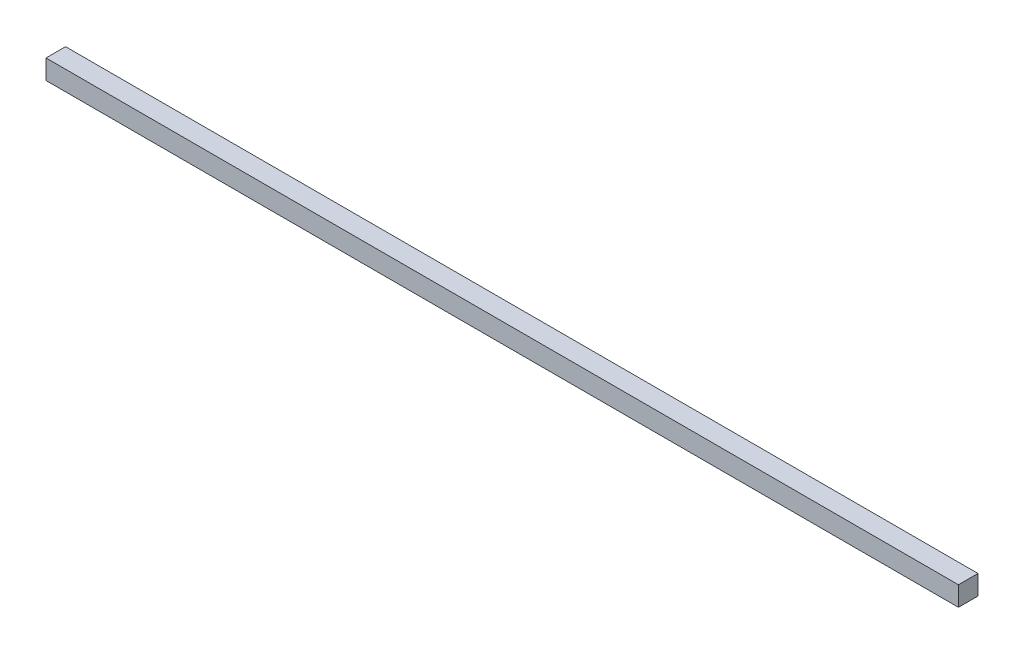
ISO-10303-21;
HEADER;
FILE_DESCRIPTION(('STEP AP214'),'2;1');
FILE_NAME('part.step','',(''),(''),'','','');
FILE_SCHEMA(('AUTOMOTIVE_DESIGN { 1 0 10303 214 1 1 1 1 }'));
ENDSEC;
DATA;
#1=APPLICATION_CONTEXT('core data for automotive mechanical design processes');
#2=APPLICATION_PROTOCOL_DEFINITION('international standard','automotive_design',2000,#1);
#3=PRODUCT_CONTEXT('',#1,'mechanical');
#4=PRODUCT('Part','Part','',(#3));
#5=PRODUCT_RELATED_PRODUCT_CATEGORY('part','',(#4));
#6=PRODUCT_DEFINITION_FORMATION('','',#4);
#7=PRODUCT_DEFINITION_CONTEXT('part definition',#1,'design');
#8=PRODUCT_DEFINITION('design','',#6,#7);
#9=PRODUCT_DEFINITION_SHAPE('','',#8);
#10=(LENGTH_UNIT() NAMED_UNIT(*) SI_UNIT(.MILLI.,.METRE.));
#11=(NAMED_UNIT(*) PLANE_ANGLE_UNIT() SI_UNIT($,.RADIAN.));
#12=(NAMED_UNIT(*) SI_UNIT($,.STERADIAN.) SOLID_ANGLE_UNIT());
#13=UNCERTAINTY_MEASURE_WITH_UNIT(LENGTH_MEASURE(1.E-05),#10,'distance_accuracy_value','');
#14=(GEOMETRIC_REPRESENTATION_CONTEXT(3) GLOBAL_UNCERTAINTY_ASSIGNED_CONTEXT((#13)) GLOBAL_UNIT_ASSIGNED_CONTEXT((#10,
#11,#12)) REPRESENTATION_CONTEXT('',''));
#15=CARTESIAN_POINT('',(0.,0.,0.));
#16=DIRECTION('',(0.,0.,1.));
#17=DIRECTION('',(1.,0.,0.));
#18=AXIS2_PLACEMENT_3D('',#15,#16,#17);
#19=CARTESIAN_POINT('',(700.,0.,0.));
#20=DIRECTION('',(0.,0.,1.));
#21=DIRECTION('',(0.,-1.,0.));
#22=AXIS2_PLACEMENT_3D('',#19,#20,#21);
#23=PLANE('',#22);
#24=DIRECTION('',(0.,1.,0.));
#25=VECTOR('',#24,1.);
#26=CARTESIAN_POINT('',(0.,0.,0.));
#27=LINE('',#26,#25);
#28=CARTESIAN_POINT('',(0.,0.,0.));
#29=VERTEX_POINT('',#28);
#30=CARTESIAN_POINT('',(0.,15.,0.));
#31=VERTEX_POINT('',#30);
#32=EDGE_CURVE('E98',#29,#31,#27,.T.);
#33=ORIENTED_EDGE('',*,*,#32,.F.);
#34=DIRECTION('',(-1.,0.,0.));
#35=VECTOR('',#34,1.);
#36=CARTESIAN_POINT('',(700.,0.,0.));
#37=LINE('',#36,#35);
#38=CARTESIAN_POINT('',(700.,0.,0.));
#39=VERTEX_POINT('',#38);
#40=EDGE_CURVE('E11',#39,#29,#37,.T.);
#41=ORIENTED_EDGE('',*,*,#40,.F.);
#42=DIRECTION('',(0.,1.,0.));
#43=VECTOR('',#42,1.);
#44=CARTESIAN_POINT('',(700.,0.,0.));
#45=LINE('',#44,#43);
#46=CARTESIAN_POINT('',(700.,15.,0.));
#47=VERTEX_POINT('',#46);
#48=EDGE_CURVE('E93',#39,#47,#45,.T.);
#49=ORIENTED_EDGE('',*,*,#48,.T.);
#50=DIRECTION('',(-1.,0.,0.));
#51=VECTOR('',#50,1.);
#52=CARTESIAN_POINT('',(700.,15.,0.));
#53=LINE('',#52,#51);
#54=EDGE_CURVE('E36',#47,#31,#53,.T.);
#55=ORIENTED_EDGE('',*,*,#54,.T.);
#56=EDGE_LOOP('',(#33,#41,#49,#55));
#57=FACE_BOUND('',#56,.T.);
#58=ADVANCED_FACE('F33',(#57),#23,.T.);
#59=CARTESIAN_POINT('',(700.,0.,0.));
#60=DIRECTION('',(0.,1.,0.));
#61=DIRECTION('',(0.,0.,1.));
#62=AXIS2_PLACEMENT_3D('',#59,#60,#61);
#63=PLANE('',#62);
#64=DIRECTION('',(0.,0.,-1.));
#65=VECTOR('',#64,1.);
#66=CARTESIAN_POINT('',(0.,0.,0.));
#67=LINE('',#66,#65);
#68=CARTESIAN_POINT('',(0.,0.,-15.));
#69=VERTEX_POINT('',#68);
#70=EDGE_CURVE('E66',#29,#69,#67,.T.);
#71=ORIENTED_EDGE('',*,*,#70,.T.);
#72=DIRECTION('',(-1.,0.,0.));
#73=VECTOR('',#72,1.);
#74=CARTESIAN_POINT('',(700.,0.,-15.));
#75=LINE('',#74,#73);
#76=CARTESIAN_POINT('',(700.,0.,-15.));
#77=VERTEX_POINT('',#76);
#78=EDGE_CURVE('E42',#77,#69,#75,.T.);
#79=ORIENTED_EDGE('',*,*,#78,.F.);
#80=DIRECTION('',(0.,0.,-1.));
#81=VECTOR('',#80,1.);
#82=CARTESIAN_POINT('',(700.,0.,0.));
#83=LINE('',#82,#81);
#84=EDGE_CURVE('E83',#39,#77,#83,.T.);
#85=ORIENTED_EDGE('',*,*,#84,.F.);
#86=ORIENTED_EDGE('',*,*,#40,.T.);
#87=EDGE_LOOP('',(#71,#79,#85,#86));
#88=FACE_BOUND('',#87,.T.);
#89=ADVANCED_FACE('F108',(#88),#63,.F.);
#90=CARTESIAN_POINT('',(700.,0.,-15.));
#91=DIRECTION('',(0.,0.,1.));
#92=DIRECTION('',(0.,-1.,0.));
#93=AXIS2_PLACEMENT_3D('',#90,#91,#92);
#94=PLANE('',#93);
#95=DIRECTION('',(0.,1.,0.));
#96=VECTOR('',#95,1.);
#97=CARTESIAN_POINT('',(0.,0.,-15.));
#98=LINE('',#97,#96);
#99=CARTESIAN_POINT('',(0.,15.,-15.));
#100=VERTEX_POINT('',#99);
#101=EDGE_CURVE('E90',#69,#100,#98,.T.);
#102=ORIENTED_EDGE('',*,*,#101,.T.);
#103=DIRECTION('',(-1.,0.,0.));
#104=VECTOR('',#103,1.);
#105=CARTESIAN_POINT('',(700.,15.,-15.));
#106=LINE('',#105,#104);
#107=CARTESIAN_POINT('',(700.,15.,-15.));
#108=VERTEX_POINT('',#107);
#109=EDGE_CURVE('E87',#108,#100,#106,.T.);
#110=ORIENTED_EDGE('',*,*,#109,.F.);
#111=DIRECTION('',(0.,1.,0.));
#112=VECTOR('',#111,1.);
#113=CARTESIAN_POINT('',(700.,0.,-15.));
#114=LINE('',#113,#112);
#115=EDGE_CURVE('E78',#77,#108,#114,.T.);
#116=ORIENTED_EDGE('',*,*,#115,.F.);
#117=ORIENTED_EDGE('',*,*,#78,.T.);
#118=EDGE_LOOP('',(#102,#110,#116,#117));
#119=FACE_BOUND('',#118,.T.);
#120=ADVANCED_FACE('F88',(#119),#94,.F.);
#121=CARTESIAN_POINT('',(700.,15.,0.));
#122=DIRECTION('',(0.,1.,0.));
#123=DIRECTION('',(0.,0.,1.));
#124=AXIS2_PLACEMENT_3D('',#121,#122,#123);
#125=PLANE('',#124);
#126=DIRECTION('',(0.,0.,-1.));
#127=VECTOR('',#126,1.);
#128=CARTESIAN_POINT('',(0.,15.,0.));
#129=LINE('',#128,#127);
#130=EDGE_CURVE('E101',#31,#100,#129,.T.);
#131=ORIENTED_EDGE('',*,*,#130,.F.);
#132=ORIENTED_EDGE('',*,*,#54,.F.);
#133=DIRECTION('',(0.,0.,-1.));
#134=VECTOR('',#133,1.);
#135=CARTESIAN_POINT('',(700.,15.,0.));
#136=LINE('',#135,#134);
#137=EDGE_CURVE('E82',#47,#108,#136,.T.);
#138=ORIENTED_EDGE('',*,*,#137,.T.);
#139=ORIENTED_EDGE('',*,*,#109,.T.);
#140=EDGE_LOOP('',(#131,#132,#138,#139));
#141=FACE_BOUND('',#140,.T.);
#142=ADVANCED_FACE('F92',(#141),#125,.T.);
#143=CARTESIAN_POINT('',(700.,0.,0.));
#144=DIRECTION('',(-1.,0.,0.));
#145=DIRECTION('',(0.,0.,1.));
#146=AXIS2_PLACEMENT_3D('',#143,#144,#145);
#147=PLANE('',#146);
#148=ORIENTED_EDGE('',*,*,#48,.F.);
#149=ORIENTED_EDGE('',*,*,#84,.T.);
#150=ORIENTED_EDGE('',*,*,#115,.T.);
#151=ORIENTED_EDGE('',*,*,#137,.F.);
#152=EDGE_LOOP('',(#148,#149,#150,#151));
#153=FACE_BOUND('',#152,.T.);
#154=ADVANCED_FACE('F81',(#153),#147,.F.);
#155=CARTESIAN_POINT('',(0.,0.,0.));
#156=DIRECTION('',(-1.,0.,0.));
#157=DIRECTION('',(0.,0.,1.));
#158=AXIS2_PLACEMENT_3D('',#155,#156,#157);
#159=PLANE('',#158);
#160=ORIENTED_EDGE('',*,*,#32,.T.);
#161=ORIENTED_EDGE('',*,*,#130,.T.);
#162=ORIENTED_EDGE('',*,*,#101,.F.);
#163=ORIENTED_EDGE('',*,*,#70,.F.);
#164=EDGE_LOOP('',(#160,#161,#162,#163));
#165=FACE_BOUND('',#164,.T.);
#166=ADVANCED_FACE('F106',(#165),#159,.T.);
#167=CLOSED_SHELL('',(#58,#89,#120,#142,#154,#166));
#168=MANIFOLD_SOLID_BREP('B2',#167);
#169=ADVANCED_BREP_SHAPE_REPRESENTATION('',(#18,#168),#14);
#170=SHAPE_DEFINITION_REPRESENTATION(#9,#169);
ENDSEC;
END-ISO-10303-21;
